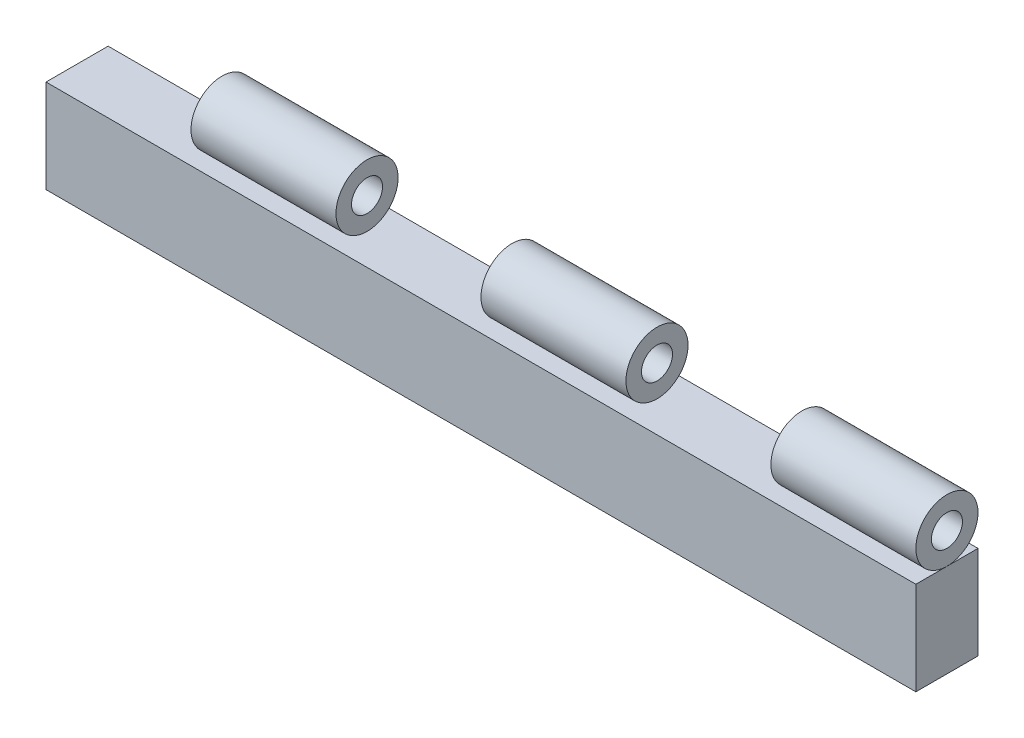
ISO-10303-21;
HEADER;
FILE_DESCRIPTION(('STEP AP214'),'2;1');
FILE_NAME('part.step','',(''),(''),'','','');
FILE_SCHEMA(('AUTOMOTIVE_DESIGN { 1 0 10303 214 1 1 1 1 }'));
ENDSEC;
DATA;
#1=APPLICATION_CONTEXT('core data for automotive mechanical design processes');
#2=APPLICATION_PROTOCOL_DEFINITION('international standard','automotive_design',2000,#1);
#3=PRODUCT_CONTEXT('',#1,'mechanical');
#4=PRODUCT('Part','Part','',(#3));
#5=PRODUCT_RELATED_PRODUCT_CATEGORY('part','',(#4));
#6=PRODUCT_DEFINITION_FORMATION('','',#4);
#7=PRODUCT_DEFINITION_CONTEXT('part definition',#1,'design');
#8=PRODUCT_DEFINITION('design','',#6,#7);
#9=PRODUCT_DEFINITION_SHAPE('','',#8);
#10=(LENGTH_UNIT() NAMED_UNIT(*) SI_UNIT(.MILLI.,.METRE.));
#11=(NAMED_UNIT(*) PLANE_ANGLE_UNIT() SI_UNIT($,.RADIAN.));
#12=(NAMED_UNIT(*) SI_UNIT($,.STERADIAN.) SOLID_ANGLE_UNIT());
#13=UNCERTAINTY_MEASURE_WITH_UNIT(LENGTH_MEASURE(1.E-05),#10,'distance_accuracy_value','');
#14=(GEOMETRIC_REPRESENTATION_CONTEXT(3) GLOBAL_UNCERTAINTY_ASSIGNED_CONTEXT((#13)) GLOBAL_UNIT_ASSIGNED_CONTEXT((#10,
#11,#12)) REPRESENTATION_CONTEXT('',''));
#15=CARTESIAN_POINT('',(0.,0.,0.));
#16=DIRECTION('',(0.,0.,1.));
#17=DIRECTION('',(1.,0.,0.));
#18=AXIS2_PLACEMENT_3D('',#15,#16,#17);
#19=CARTESIAN_POINT('',(58.3333333333333,12.5,5.));
#20=DIRECTION('',(1.,0.,0.));
#21=DIRECTION('',(0.,0.,-1.));
#22=AXIS2_PLACEMENT_3D('',#19,#20,#21);
#23=CYLINDRICAL_SURFACE('',#22,5.);
#24=CARTESIAN_POINT('',(0.,12.5,5.));
#25=DIRECTION('',(1.,0.,0.));
#26=DIRECTION('',(0.,0.,-1.));
#27=AXIS2_PLACEMENT_3D('',#24,#25,#26);
#28=CIRCLE('',#27,5.);
#29=CARTESIAN_POINT('',(0.,12.5,0.));
#30=VERTEX_POINT('',#29);
#31=EDGE_CURVE('P0_E28',#30,#30,#28,.T.);
#32=ORIENTED_EDGE('',*,*,#31,.T.);
#33=EDGE_LOOP('',(#32));
#34=FACE_BOUND('',#33,.T.);
#35=CARTESIAN_POINT('',(23.3333333333333,12.5,5.));
#36=DIRECTION('',(1.,0.,0.));
#37=DIRECTION('',(0.,0.,-1.));
#38=AXIS2_PLACEMENT_3D('',#35,#36,#37);
#39=CIRCLE('',#38,5.);
#40=CARTESIAN_POINT('',(23.3333333333333,12.5,0.));
#41=VERTEX_POINT('',#40);
#42=EDGE_CURVE('P0_E10',#41,#41,#39,.T.);
#43=ORIENTED_EDGE('',*,*,#42,.F.);
#44=EDGE_LOOP('',(#43));
#45=FACE_BOUND('',#44,.T.);
#46=ADVANCED_FACE('P0_F15',(#34,#45),#23,.T.);
#47=CARTESIAN_POINT('',(23.3333333333333,7.50000000000002,0.));
#48=DIRECTION('',(-1.,0.,0.));
#49=DIRECTION('',(0.,0.,1.));
#50=AXIS2_PLACEMENT_3D('',#47,#48,#49);
#51=PLANE('',#50);
#52=ORIENTED_EDGE('',*,*,#42,.T.);
#53=EDGE_LOOP('',(#52));
#54=FACE_BOUND('',#53,.T.);
#55=CARTESIAN_POINT('',(23.3333333333333,12.5,5.));
#56=DIRECTION('',(1.,0.,0.));
#57=DIRECTION('',(0.,0.,1.));
#58=AXIS2_PLACEMENT_3D('',#55,#56,#57);
#59=CIRCLE('',#58,2.5);
#60=CARTESIAN_POINT('',(23.3333333333333,12.5,7.5));
#61=VERTEX_POINT('',#60);
#62=EDGE_CURVE('P0_E23',#61,#61,#59,.T.);
#63=ORIENTED_EDGE('',*,*,#62,.F.);
#64=EDGE_LOOP('',(#63));
#65=FACE_BOUND('',#64,.T.);
#66=ADVANCED_FACE('P0_F42',(#54,#65),#51,.F.);
#67=CARTESIAN_POINT('',(0.,0.,0.));
#68=DIRECTION('',(1.,0.,0.));
#69=DIRECTION('',(0.,0.,-1.));
#70=AXIS2_PLACEMENT_3D('',#67,#68,#69);
#71=PLANE('',#70);
#72=ORIENTED_EDGE('',*,*,#31,.F.);
#73=EDGE_LOOP('',(#72));
#74=FACE_BOUND('',#73,.T.);
#75=CARTESIAN_POINT('',(0.,12.5,5.));
#76=DIRECTION('',(1.,0.,0.));
#77=DIRECTION('',(0.,0.,-1.));
#78=AXIS2_PLACEMENT_3D('',#75,#76,#77);
#79=CIRCLE('',#78,2.5);
#80=CARTESIAN_POINT('',(0.,12.5,2.5));
#81=VERTEX_POINT('',#80);
#82=EDGE_CURVE('P0_E19',#81,#81,#79,.T.);
#83=ORIENTED_EDGE('',*,*,#82,.T.);
#84=EDGE_LOOP('',(#83));
#85=FACE_BOUND('',#84,.T.);
#86=ADVANCED_FACE('P0_F36',(#74,#85),#71,.F.);
#87=CARTESIAN_POINT('',(58.3333333333333,12.5,5.));
#88=DIRECTION('',(1.,0.,0.));
#89=DIRECTION('',(0.,0.,-1.));
#90=AXIS2_PLACEMENT_3D('',#87,#88,#89);
#91=CYLINDRICAL_SURFACE('',#90,2.5);
#92=ORIENTED_EDGE('',*,*,#82,.F.);
#93=EDGE_LOOP('',(#92));
#94=FACE_BOUND('',#93,.T.);
#95=ORIENTED_EDGE('',*,*,#62,.T.);
#96=EDGE_LOOP('',(#95));
#97=FACE_BOUND('',#96,.T.);
#98=ADVANCED_FACE('P0_F17',(#94,#97),#91,.F.);
#99=CLOSED_SHELL('',(#46,#66,#86,#98));
#100=MANIFOLD_SOLID_BREP('P0_B1',#99);
#101=CARTESIAN_POINT('',(-70.,-7.50000000000002,0.));
#102=DIRECTION('',(1.,0.,0.));
#103=DIRECTION('',(0.,0.,-1.));
#104=AXIS2_PLACEMENT_3D('',#101,#102,#103);
#105=PLANE('',#104);
#106=DIRECTION('',(0.,-1.,0.));
#107=VECTOR('',#106,1.);
#108=CARTESIAN_POINT('',(-70.,0.,10.));
#109=LINE('',#108,#107);
#110=CARTESIAN_POINT('',(-70.,7.5,10.));
#111=VERTEX_POINT('',#110);
#112=CARTESIAN_POINT('',(-70.,-7.50000000000002,10.));
#113=VERTEX_POINT('',#112);
#114=EDGE_CURVE('P1_E11',#111,#113,#109,.T.);
#115=ORIENTED_EDGE('',*,*,#114,.F.);
#116=DIRECTION('',(0.,0.,1.));
#117=VECTOR('',#116,1.);
#118=CARTESIAN_POINT('',(-70.,7.5,5.));
#119=LINE('',#118,#117);
#120=CARTESIAN_POINT('',(-70.,7.5,0.));
#121=VERTEX_POINT('',#120);
#122=EDGE_CURVE('P1_E27',#121,#111,#119,.T.);
#123=ORIENTED_EDGE('',*,*,#122,.F.);
#124=DIRECTION('',(0.,-1.,0.));
#125=VECTOR('',#124,1.);
#126=CARTESIAN_POINT('',(-70.,0.,0.));
#127=LINE('',#126,#125);
#128=CARTESIAN_POINT('',(-70.,-7.50000000000002,0.));
#129=VERTEX_POINT('',#128);
#130=EDGE_CURVE('P1_E75',#121,#129,#127,.T.);
#131=ORIENTED_EDGE('',*,*,#130,.T.);
#132=DIRECTION('',(0.,0.,1.));
#133=VECTOR('',#132,1.);
#134=CARTESIAN_POINT('',(-70.,-7.50000000000002,5.));
#135=LINE('',#134,#133);
#136=EDGE_CURVE('P1_E36',#129,#113,#135,.T.);
#137=ORIENTED_EDGE('',*,*,#136,.T.);
#138=EDGE_LOOP('',(#115,#123,#131,#137));
#139=FACE_BOUND('',#138,.T.);
#140=ADVANCED_FACE('P1_F17',(#139),#105,.F.);
#141=CARTESIAN_POINT('',(70.,-7.50000000000001,0.));
#142=DIRECTION('',(0.,1.,0.));
#143=DIRECTION('',(0.,0.,1.));
#144=AXIS2_PLACEMENT_3D('',#141,#142,#143);
#145=PLANE('',#144);
#146=DIRECTION('',(1.,0.,0.));
#147=VECTOR('',#146,1.);
#148=CARTESIAN_POINT('',(0.,-7.50000000000001,10.));
#149=LINE('',#148,#147);
#150=CARTESIAN_POINT('',(70.,-7.50000000000001,10.));
#151=VERTEX_POINT('',#150);
#152=EDGE_CURVE('P1_E83',#113,#151,#149,.T.);
#153=ORIENTED_EDGE('',*,*,#152,.F.);
#154=ORIENTED_EDGE('',*,*,#136,.F.);
#155=DIRECTION('',(1.,0.,0.));
#156=VECTOR('',#155,1.);
#157=CARTESIAN_POINT('',(0.,-7.50000000000001,0.));
#158=LINE('',#157,#156);
#159=CARTESIAN_POINT('',(70.,-7.50000000000001,0.));
#160=VERTEX_POINT('',#159);
#161=EDGE_CURVE('P1_E72',#129,#160,#158,.T.);
#162=ORIENTED_EDGE('',*,*,#161,.T.);
#163=DIRECTION('',(0.,0.,1.));
#164=VECTOR('',#163,1.);
#165=CARTESIAN_POINT('',(70.,-7.50000000000001,5.));
#166=LINE('',#165,#164);
#167=EDGE_CURVE('P1_E69',#160,#151,#166,.T.);
#168=ORIENTED_EDGE('',*,*,#167,.T.);
#169=EDGE_LOOP('',(#153,#154,#162,#168));
#170=FACE_BOUND('',#169,.T.);
#171=ADVANCED_FACE('P1_F91',(#170),#145,.F.);
#172=CARTESIAN_POINT('',(70.,7.50000000000002,0.));
#173=DIRECTION('',(-1.,0.,0.));
#174=DIRECTION('',(0.,0.,1.));
#175=AXIS2_PLACEMENT_3D('',#172,#173,#174);
#176=PLANE('',#175);
#177=DIRECTION('',(0.,1.,0.));
#178=VECTOR('',#177,1.);
#179=CARTESIAN_POINT('',(70.,0.,10.));
#180=LINE('',#179,#178);
#181=CARTESIAN_POINT('',(70.,7.5,10.));
#182=VERTEX_POINT('',#181);
#183=EDGE_CURVE('P1_E77',#151,#182,#180,.T.);
#184=ORIENTED_EDGE('',*,*,#183,.F.);
#185=ORIENTED_EDGE('',*,*,#167,.F.);
#186=DIRECTION('',(0.,1.,0.));
#187=VECTOR('',#186,1.);
#188=CARTESIAN_POINT('',(70.,0.,0.));
#189=LINE('',#188,#187);
#190=CARTESIAN_POINT('',(70.,7.5,0.));
#191=VERTEX_POINT('',#190);
#192=EDGE_CURVE('P1_E64',#160,#191,#189,.T.);
#193=ORIENTED_EDGE('',*,*,#192,.T.);
#194=DIRECTION('',(0.,0.,1.));
#195=VECTOR('',#194,1.);
#196=CARTESIAN_POINT('',(70.,7.50000000000002,7.5));
#197=LINE('',#196,#195);
#198=EDGE_CURVE('P1_E55',#191,#182,#197,.T.);
#199=ORIENTED_EDGE('',*,*,#198,.T.);
#200=EDGE_LOOP('',(#184,#185,#193,#199));
#201=FACE_BOUND('',#200,.T.);
#202=ADVANCED_FACE('P1_F68',(#201),#176,.F.);
#203=CARTESIAN_POINT('',(0.,0.,0.));
#204=DIRECTION('',(0.,0.,1.));
#205=DIRECTION('',(1.,0.,0.));
#206=AXIS2_PLACEMENT_3D('',#203,#204,#205);
#207=PLANE('',#206);
#208=DIRECTION('',(-1.,0.,0.));
#209=VECTOR('',#208,1.);
#210=CARTESIAN_POINT('',(0.,7.5,0.));
#211=LINE('',#210,#209);
#212=EDGE_CURVE('P1_E62',#191,#121,#211,.T.);
#213=ORIENTED_EDGE('',*,*,#212,.F.);
#214=ORIENTED_EDGE('',*,*,#192,.F.);
#215=ORIENTED_EDGE('',*,*,#161,.F.);
#216=ORIENTED_EDGE('',*,*,#130,.F.);
#217=EDGE_LOOP('',(#213,#214,#215,#216));
#218=FACE_BOUND('',#217,.T.);
#219=ADVANCED_FACE('P1_F74',(#218),#207,.F.);
#220=CARTESIAN_POINT('',(0.,0.,10.));
#221=DIRECTION('',(0.,0.,1.));
#222=DIRECTION('',(1.,0.,0.));
#223=AXIS2_PLACEMENT_3D('',#220,#221,#222);
#224=PLANE('',#223);
#225=ORIENTED_EDGE('',*,*,#183,.T.);
#226=DIRECTION('',(-1.,0.,0.));
#227=VECTOR('',#226,1.);
#228=CARTESIAN_POINT('',(0.,7.5,10.));
#229=LINE('',#228,#227);
#230=EDGE_CURVE('P1_E21',#182,#111,#229,.T.);
#231=ORIENTED_EDGE('',*,*,#230,.T.);
#232=ORIENTED_EDGE('',*,*,#114,.T.);
#233=ORIENTED_EDGE('',*,*,#152,.T.);
#234=EDGE_LOOP('',(#225,#231,#232,#233));
#235=FACE_BOUND('',#234,.T.);
#236=ADVANCED_FACE('P1_F89',(#235),#224,.T.);
#237=CARTESIAN_POINT('',(-70.,7.5,0.));
#238=DIRECTION('',(0.,-1.,0.));
#239=DIRECTION('',(0.,0.,-1.));
#240=AXIS2_PLACEMENT_3D('',#237,#238,#239);
#241=PLANE('',#240);
#242=ORIENTED_EDGE('',*,*,#198,.F.);
#243=ORIENTED_EDGE('',*,*,#212,.T.);
#244=ORIENTED_EDGE('',*,*,#122,.T.);
#245=ORIENTED_EDGE('',*,*,#230,.F.);
#246=EDGE_LOOP('',(#242,#243,#244,#245));
#247=FACE_BOUND('',#246,.T.);
#248=ADVANCED_FACE('P1_F19',(#247),#241,.F.);
#249=CLOSED_SHELL('',(#140,#171,#202,#219,#236,#248));
#250=MANIFOLD_SOLID_BREP('P1_B1',#249);
#251=CARTESIAN_POINT('',(58.3333333333333,12.5,5.));
#252=DIRECTION('',(1.,0.,0.));
#253=DIRECTION('',(0.,0.,-1.));
#254=AXIS2_PLACEMENT_3D('',#251,#252,#253);
#255=CYLINDRICAL_SURFACE('',#254,5.);
#256=CARTESIAN_POINT('',(46.6666666666667,12.5,5.));
#257=DIRECTION('',(1.,0.,0.));
#258=DIRECTION('',(0.,0.,-1.));
#259=AXIS2_PLACEMENT_3D('',#256,#257,#258);
#260=CIRCLE('',#259,5.);
#261=CARTESIAN_POINT('',(46.6666666666667,12.5,0.));
#262=VERTEX_POINT('',#261);
#263=EDGE_CURVE('P2_E28',#262,#262,#260,.T.);
#264=ORIENTED_EDGE('',*,*,#263,.T.);
#265=EDGE_LOOP('',(#264));
#266=FACE_BOUND('',#265,.T.);
#267=CARTESIAN_POINT('',(70.,12.5,5.));
#268=DIRECTION('',(1.,0.,0.));
#269=DIRECTION('',(0.,0.,-1.));
#270=AXIS2_PLACEMENT_3D('',#267,#268,#269);
#271=CIRCLE('',#270,5.);
#272=CARTESIAN_POINT('',(70.,12.5,0.));
#273=VERTEX_POINT('',#272);
#274=EDGE_CURVE('P2_E9',#273,#273,#271,.T.);
#275=ORIENTED_EDGE('',*,*,#274,.F.);
#276=EDGE_LOOP('',(#275));
#277=FACE_BOUND('',#276,.T.);
#278=ADVANCED_FACE('P2_F14',(#266,#277),#255,.T.);
#279=CARTESIAN_POINT('',(58.3333333333333,12.5,5.));
#280=DIRECTION('',(1.,0.,0.));
#281=DIRECTION('',(0.,0.,-1.));
#282=AXIS2_PLACEMENT_3D('',#279,#280,#281);
#283=CYLINDRICAL_SURFACE('',#282,2.5);
#284=CARTESIAN_POINT('',(46.6666666666667,12.5,5.));
#285=DIRECTION('',(1.,0.,0.));
#286=DIRECTION('',(0.,0.,-1.));
#287=AXIS2_PLACEMENT_3D('',#284,#285,#286);
#288=CIRCLE('',#287,2.5);
#289=CARTESIAN_POINT('',(46.6666666666667,12.5,2.5));
#290=VERTEX_POINT('',#289);
#291=EDGE_CURVE('P2_E22',#290,#290,#288,.T.);
#292=ORIENTED_EDGE('',*,*,#291,.F.);
#293=EDGE_LOOP('',(#292));
#294=FACE_BOUND('',#293,.T.);
#295=CARTESIAN_POINT('',(70.,12.5,5.));
#296=DIRECTION('',(1.,0.,0.));
#297=DIRECTION('',(0.,0.,-1.));
#298=AXIS2_PLACEMENT_3D('',#295,#296,#297);
#299=CIRCLE('',#298,2.5);
#300=CARTESIAN_POINT('',(70.,12.5,2.5));
#301=VERTEX_POINT('',#300);
#302=EDGE_CURVE('P2_E18',#301,#301,#299,.T.);
#303=ORIENTED_EDGE('',*,*,#302,.T.);
#304=EDGE_LOOP('',(#303));
#305=FACE_BOUND('',#304,.T.);
#306=ADVANCED_FACE('P2_F35',(#294,#305),#283,.F.);
#307=CARTESIAN_POINT('',(70.,7.50000000000002,0.));
#308=DIRECTION('',(-1.,0.,0.));
#309=DIRECTION('',(0.,0.,1.));
#310=AXIS2_PLACEMENT_3D('',#307,#308,#309);
#311=PLANE('',#310);
#312=ORIENTED_EDGE('',*,*,#274,.T.);
#313=EDGE_LOOP('',(#312));
#314=FACE_BOUND('',#313,.T.);
#315=ORIENTED_EDGE('',*,*,#302,.F.);
#316=EDGE_LOOP('',(#315));
#317=FACE_BOUND('',#316,.T.);
#318=ADVANCED_FACE('P2_F37',(#314,#317),#311,.F.);
#319=CARTESIAN_POINT('',(46.6666666666667,0.,0.));
#320=DIRECTION('',(1.,0.,0.));
#321=DIRECTION('',(0.,0.,-1.));
#322=AXIS2_PLACEMENT_3D('',#319,#320,#321);
#323=PLANE('',#322);
#324=ORIENTED_EDGE('',*,*,#263,.F.);
#325=EDGE_LOOP('',(#324));
#326=FACE_BOUND('',#325,.T.);
#327=ORIENTED_EDGE('',*,*,#291,.T.);
#328=EDGE_LOOP('',(#327));
#329=FACE_BOUND('',#328,.T.);
#330=ADVANCED_FACE('P2_F16',(#326,#329),#323,.F.);
#331=CLOSED_SHELL('',(#278,#306,#318,#330));
#332=MANIFOLD_SOLID_BREP('P2_B1',#331);
#333=CARTESIAN_POINT('',(58.3333333333333,12.5,5.));
#334=DIRECTION('',(1.,0.,0.));
#335=DIRECTION('',(0.,0.,-1.));
#336=AXIS2_PLACEMENT_3D('',#333,#334,#335);
#337=CYLINDRICAL_SURFACE('',#336,5.);
#338=CARTESIAN_POINT('',(-46.6666666666667,12.5,5.));
#339=DIRECTION('',(1.,0.,0.));
#340=DIRECTION('',(0.,0.,-1.));
#341=AXIS2_PLACEMENT_3D('',#338,#339,#340);
#342=CIRCLE('',#341,5.);
#343=CARTESIAN_POINT('',(-46.6666666666667,12.5,0.));
#344=VERTEX_POINT('',#343);
#345=EDGE_CURVE('P3_E27',#344,#344,#342,.T.);
#346=ORIENTED_EDGE('',*,*,#345,.T.);
#347=EDGE_LOOP('',(#346));
#348=FACE_BOUND('',#347,.T.);
#349=CARTESIAN_POINT('',(-23.3333333333333,12.5,5.));
#350=DIRECTION('',(1.,0.,0.));
#351=DIRECTION('',(0.,0.,-1.));
#352=AXIS2_PLACEMENT_3D('',#349,#350,#351);
#353=CIRCLE('',#352,5.);
#354=CARTESIAN_POINT('',(-23.3333333333333,12.5,0.));
#355=VERTEX_POINT('',#354);
#356=EDGE_CURVE('P3_E9',#355,#355,#353,.T.);
#357=ORIENTED_EDGE('',*,*,#356,.F.);
#358=EDGE_LOOP('',(#357));
#359=FACE_BOUND('',#358,.T.);
#360=ADVANCED_FACE('P3_F14',(#348,#359),#337,.T.);
#361=CARTESIAN_POINT('',(-23.3333333333333,7.50000000000002,0.));
#362=DIRECTION('',(-1.,0.,0.));
#363=DIRECTION('',(0.,0.,1.));
#364=AXIS2_PLACEMENT_3D('',#361,#362,#363);
#365=PLANE('',#364);
#366=ORIENTED_EDGE('',*,*,#356,.T.);
#367=EDGE_LOOP('',(#366));
#368=FACE_BOUND('',#367,.T.);
#369=CARTESIAN_POINT('',(-23.3333333333333,12.5,5.));
#370=DIRECTION('',(1.,0.,0.));
#371=DIRECTION('',(0.,0.,1.));
#372=AXIS2_PLACEMENT_3D('',#369,#370,#371);
#373=CIRCLE('',#372,2.5);
#374=CARTESIAN_POINT('',(-23.3333333333333,12.5,7.5));
#375=VERTEX_POINT('',#374);
#376=EDGE_CURVE('P3_E22',#375,#375,#373,.T.);
#377=ORIENTED_EDGE('',*,*,#376,.F.);
#378=EDGE_LOOP('',(#377));
#379=FACE_BOUND('',#378,.T.);
#380=ADVANCED_FACE('P3_F41',(#368,#379),#365,.F.);
#381=CARTESIAN_POINT('',(-46.6666666666667,0.,0.));
#382=DIRECTION('',(1.,0.,0.));
#383=DIRECTION('',(0.,0.,-1.));
#384=AXIS2_PLACEMENT_3D('',#381,#382,#383);
#385=PLANE('',#384);
#386=ORIENTED_EDGE('',*,*,#345,.F.);
#387=EDGE_LOOP('',(#386));
#388=FACE_BOUND('',#387,.T.);
#389=CARTESIAN_POINT('',(-46.6666666666667,12.5,5.));
#390=DIRECTION('',(1.,0.,0.));
#391=DIRECTION('',(0.,0.,-1.));
#392=AXIS2_PLACEMENT_3D('',#389,#390,#391);
#393=CIRCLE('',#392,2.5);
#394=CARTESIAN_POINT('',(-46.6666666666667,12.5,2.5));
#395=VERTEX_POINT('',#394);
#396=EDGE_CURVE('P3_E18',#395,#395,#393,.T.);
#397=ORIENTED_EDGE('',*,*,#396,.T.);
#398=EDGE_LOOP('',(#397));
#399=FACE_BOUND('',#398,.T.);
#400=ADVANCED_FACE('P3_F35',(#388,#399),#385,.F.);
#401=CARTESIAN_POINT('',(58.3333333333333,12.5,5.));
#402=DIRECTION('',(1.,0.,0.));
#403=DIRECTION('',(0.,0.,-1.));
#404=AXIS2_PLACEMENT_3D('',#401,#402,#403);
#405=CYLINDRICAL_SURFACE('',#404,2.5);
#406=ORIENTED_EDGE('',*,*,#396,.F.);
#407=EDGE_LOOP('',(#406));
#408=FACE_BOUND('',#407,.T.);
#409=ORIENTED_EDGE('',*,*,#376,.T.);
#410=EDGE_LOOP('',(#409));
#411=FACE_BOUND('',#410,.T.);
#412=ADVANCED_FACE('P3_F16',(#408,#411),#405,.F.);
#413=CLOSED_SHELL('',(#360,#380,#400,#412));
#414=MANIFOLD_SOLID_BREP('P3_B1',#413);
#415=ADVANCED_BREP_SHAPE_REPRESENTATION('',(#18,#100,#250,#332,#414),#14);
#416=SHAPE_DEFINITION_REPRESENTATION(#9,#415);
ENDSEC;
END-ISO-10303-21;
